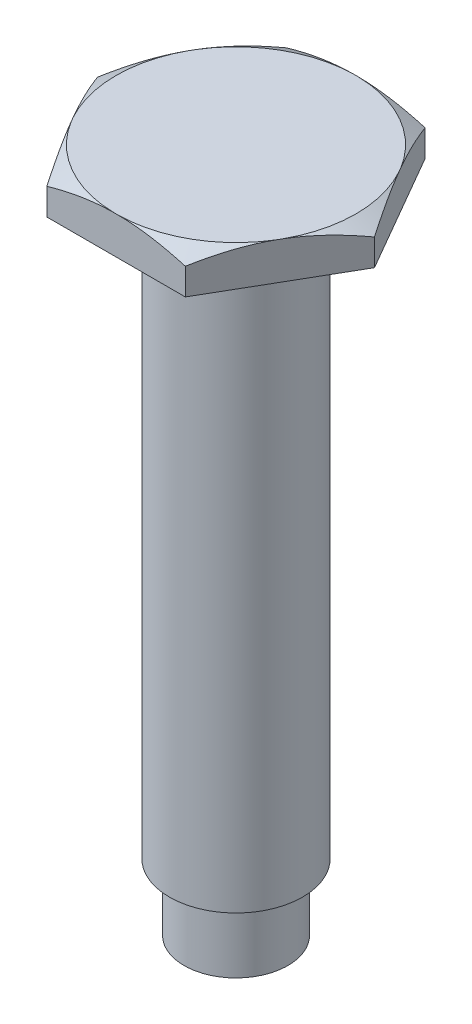
ISO-10303-21;
HEADER;
FILE_DESCRIPTION(('STEP AP214'),'2;1');
FILE_NAME('part.step','',(''),(''),'','','');
FILE_SCHEMA(('AUTOMOTIVE_DESIGN { 1 0 10303 214 1 1 1 1 }'));
ENDSEC;
DATA;
#1=APPLICATION_CONTEXT('core data for automotive mechanical design processes');
#2=APPLICATION_PROTOCOL_DEFINITION('international standard','automotive_design',2000,#1);
#3=PRODUCT_CONTEXT('',#1,'mechanical');
#4=PRODUCT('Part','Part','',(#3));
#5=PRODUCT_RELATED_PRODUCT_CATEGORY('part','',(#4));
#6=PRODUCT_DEFINITION_FORMATION('','',#4);
#7=PRODUCT_DEFINITION_CONTEXT('part definition',#1,'design');
#8=PRODUCT_DEFINITION('design','',#6,#7);
#9=PRODUCT_DEFINITION_SHAPE('','',#8);
#10=(LENGTH_UNIT() NAMED_UNIT(*) SI_UNIT(.MILLI.,.METRE.));
#11=(NAMED_UNIT(*) PLANE_ANGLE_UNIT() SI_UNIT($,.RADIAN.));
#12=(NAMED_UNIT(*) SI_UNIT($,.STERADIAN.) SOLID_ANGLE_UNIT());
#13=UNCERTAINTY_MEASURE_WITH_UNIT(LENGTH_MEASURE(1.E-05),#10,'distance_accuracy_value','');
#14=(GEOMETRIC_REPRESENTATION_CONTEXT(3) GLOBAL_UNCERTAINTY_ASSIGNED_CONTEXT((#13)) GLOBAL_UNIT_ASSIGNED_CONTEXT((#10,
#11,#12)) REPRESENTATION_CONTEXT('',''));
#15=CARTESIAN_POINT('',(0.,0.,0.));
#16=DIRECTION('',(0.,0.,1.));
#17=DIRECTION('',(1.,0.,0.));
#18=AXIS2_PLACEMENT_3D('',#15,#16,#17);
#19=CARTESIAN_POINT('',(0.,-24.3,0.));
#20=DIRECTION('',(0.,1.,0.));
#21=DIRECTION('',(0.,0.,1.));
#22=AXIS2_PLACEMENT_3D('',#19,#20,#21);
#23=CYLINDRICAL_SURFACE('',#22,2.5);
#24=CARTESIAN_POINT('',(0.,0.,0.));
#25=DIRECTION('',(0.,1.,0.));
#26=DIRECTION('',(0.,0.,1.));
#27=AXIS2_PLACEMENT_3D('',#24,#25,#26);
#28=CIRCLE('',#27,2.5);
#29=CARTESIAN_POINT('',(0.,0.,2.5));
#30=VERTEX_POINT('',#29);
#31=EDGE_CURVE('E13',#30,#30,#28,.F.);
#32=ORIENTED_EDGE('',*,*,#31,.T.);
#33=EDGE_LOOP('',(#32));
#34=FACE_BOUND('',#33,.T.);
#35=CARTESIAN_POINT('',(0.,-21.8,0.));
#36=DIRECTION('',(0.,-1.,0.));
#37=DIRECTION('',(0.,0.,-1.));
#38=AXIS2_PLACEMENT_3D('',#35,#36,#37);
#39=CIRCLE('',#38,2.5);
#40=CARTESIAN_POINT('',(0.,-21.8,-2.5));
#41=VERTEX_POINT('',#40);
#42=EDGE_CURVE('E61',#41,#41,#39,.T.);
#43=ORIENTED_EDGE('',*,*,#42,.F.);
#44=EDGE_LOOP('',(#43));
#45=FACE_BOUND('',#44,.T.);
#46=ADVANCED_FACE('F56',(#34,#45),#23,.T.);
#47=CARTESIAN_POINT('',(2.5975,1.4,4.49900197266016));
#48=DIRECTION('',(-0.866025403784439,0.,-0.5));
#49=DIRECTION('',(-0.5,0.,0.866025403784439));
#50=AXIS2_PLACEMENT_3D('',#47,#48,#49);
#51=PLANE('',#50);
#52=CARTESIAN_POINT('',(0.764746267767835,-0.454124789273067,7.67342455464776));
#53=CARTESIAN_POINT('',(0.846540705660757,-0.377433019190196,7.53175243244068));
#54=CARTESIAN_POINT('',(0.928528072742444,-0.301551957905063,7.3897461470764));
#55=CARTESIAN_POINT('',(1.09297003020882,-0.151791197053435,7.10492432184856));
#56=CARTESIAN_POINT('',(1.17542467594591,-0.0779117408474091,6.96210868611182));
#57=CARTESIAN_POINT('',(1.34112030157134,0.0676733695980131,6.67511544393666));
#58=CARTESIAN_POINT('',(1.42436293029547,0.139371540587462,6.53093498163088));
#59=CARTESIAN_POINT('',(1.59146398387532,0.279831230371151,6.24150746683229));
#60=CARTESIAN_POINT('',(1.67532238968743,0.348592839537418,6.09626044732398));
#61=CARTESIAN_POINT('',(1.84599265044855,0.484316646401144,5.80065088434469));
#62=CARTESIAN_POINT('',(1.93282376130974,0.551182431909523,5.65025498865547));
#63=CARTESIAN_POINT('',(2.10734549477341,0.680257160061498,5.3479744792714));
#64=CARTESIAN_POINT('',(2.19503606852409,0.742466365668551,5.19608995019036));
#65=CARTESIAN_POINT('',(2.37131571795982,0.861080845971694,4.89076464102724));
#66=CARTESIAN_POINT('',(2.45990392715668,0.917491222644587,4.73732536174674));
#67=CARTESIAN_POINT('',(2.63812027232068,1.02322633098802,4.42864559718346));
#68=CARTESIAN_POINT('',(2.72774827495578,1.07255196051071,4.27340534283854));
#69=CARTESIAN_POINT('',(2.94167693195855,1.17932065353719,3.90287003971477));
#70=CARTESIAN_POINT('',(3.06647240761128,1.23295723560288,3.68671793532951));
#71=CARTESIAN_POINT('',(3.25497393542946,1.29798014863304,3.36022371184407));
#72=CARTESIAN_POINT('',(3.31802487416995,1.31708228871089,3.25101628248064));
#73=CARTESIAN_POINT('',(3.44448603325496,1.34966788109555,3.03197912976134));
#74=CARTESIAN_POINT('',(3.50789620500962,1.36315207572337,2.92214949056561));
#75=CARTESIAN_POINT('',(3.63421230786921,1.3839969781063,2.7033635825987));
#76=CARTESIAN_POINT('',(3.69711530695999,1.39142837342597,2.59441239222501));
#77=CARTESIAN_POINT('',(3.82302741588169,1.40021353929659,2.37632622228448));
#78=CARTESIAN_POINT('',(3.88603652392881,1.40156741101706,2.26719124580728));
#79=CARTESIAN_POINT('',(4.01201417247894,1.39815550680156,2.04899155790038));
#80=CARTESIAN_POINT('',(4.07498271233779,1.39338963597678,1.93992684758643));
#81=CARTESIAN_POINT('',(4.20073678228329,1.37788386249752,1.72211440918226));
#82=CARTESIAN_POINT('',(4.26352230002154,1.36714356571949,1.6133667024801));
#83=CARTESIAN_POINT('',(4.41065120501361,1.33525044365775,1.35853196377184));
#84=CARTESIAN_POINT('',(4.49486953949365,1.31177164019821,1.2126615295236));
#85=CARTESIAN_POINT('',(4.66253101838631,1.25557216182377,0.922263329609364));
#86=CARTESIAN_POINT('',(4.74597403931673,1.22285003995282,0.777735777820844));
#87=CARTESIAN_POINT('',(4.91205251429679,1.14940005301191,0.490079421111826));
#88=CARTESIAN_POINT('',(4.99468708095955,1.10866424445279,0.346952153190496));
#89=CARTESIAN_POINT('',(5.15904334370627,1.02046987040766,0.0622787555710296));
#90=CARTESIAN_POINT('',(5.24076506447544,0.973011487190809,-0.0792674168831269));
#91=CARTESIAN_POINT('',(5.40431916872383,0.871907470927307,-0.362551435227752));
#92=CARTESIAN_POINT('',(5.48614102218207,0.818194179899497,-0.504271042586887));
#93=CARTESIAN_POINT('',(5.64897798391222,0.706057896456655,-0.786312933653649));
#94=CARTESIAN_POINT('',(5.72999301279723,0.647634445633892,-0.926635079859158));
#95=CARTESIAN_POINT('',(5.89125020454739,0.526954778850263,-1.2059407290563));
#96=CARTESIAN_POINT('',(5.97149278220745,0.464700769888742,-1.34492495049381));
#97=CARTESIAN_POINT('',(6.13134236600289,0.337008626902665,-1.62179255119626));
#98=CARTESIAN_POINT('',(6.21094935554493,0.271570410062166,-1.75967590172068));
#99=CARTESIAN_POINT('',(6.35269983057958,0.152286187773574,-2.00519492647773));
#100=CARTESIAN_POINT('',(6.41494928140599,0.0989419583375809,-2.11301413805233));
#101=CARTESIAN_POINT('',(6.53913777871832,-0.00915825365950849,-2.32811492511291));
#102=CARTESIAN_POINT('',(6.60107683757794,-0.063914179400276,-2.43539652203077));
#103=CARTESIAN_POINT('',(6.72394062975798,-0.173990162223894,-2.64820285249718));
#104=CARTESIAN_POINT('',(6.78486863438338,-0.229295639253393,-2.75373325211216));
#105=CARTESIAN_POINT('',(6.90648459300393,-0.340958275081431,-2.96437827145415));
#106=CARTESIAN_POINT('',(6.96717254297768,-0.397315451408354,-3.06949288421589));
#107=CARTESIAN_POINT('',(7.02775373223217,-0.454124789273058,-3.1744225819876));
#108=B_SPLINE_CURVE_WITH_KNOTS('',3,(#52,#53,#54,#55,#56,#57,#58,#59,#60,#61,#62,#63,#64,#65,
#66,#67,#68,#69,#70,#71,#72,#73,#74,#75,#76,#77,#78,#79,#80,#81,#82,#83,#84,#85,#86,#87,#88,#89,
#90,#91,#92,#93,#94,#95,#96,#97,#98,#99,#100,#101,#102,#103,#104,#105,#106,#107),.UNSPECIFIED.,
.F.,.F.,(4,2,2,2,2,2,2,2,2,2,2,2,2,2,2,2,2,2,2,2,2,2,2,2,2,2,2,4),(0.,0.542026372178204,
1.08411835228508,1.62789791735099,2.17166073564649,2.72987716868045,3.28806205464704,
3.84575155274402,4.40337031220445,5.16842888782534,5.550946692113,5.9334139367919,
6.31134777627519,6.68927532445917,7.06720873261637,7.44516707540755,7.95505681600911,
8.46502641941073,8.97550409574346,9.48596793414437,10.0025821226153,10.5192466504577,
11.0356162367859,11.5519992602125,11.9583277083475,12.3646398273455,12.7660923087187,
13.1675514869771),.UNSPECIFIED.);
#109=CARTESIAN_POINT('',(2.5975,0.998741562913211,4.49900197266016));
#110=VERTEX_POINT('',#109);
#111=CARTESIAN_POINT('',(3.84886527144745,1.4,2.33157374368596));
#112=VERTEX_POINT('',#111);
#113=EDGE_CURVE('E151',#110,#112,#108,.T.);
#114=ORIENTED_EDGE('',*,*,#113,.F.);
#115=DIRECTION('',(0.,-1.,0.));
#116=VECTOR('',#115,1.);
#117=CARTESIAN_POINT('',(2.5975,1.4,4.49900197266016));
#118=LINE('',#117,#116);
#119=CARTESIAN_POINT('',(2.5975,0.,4.49900197266016));
#120=VERTEX_POINT('',#119);
#121=EDGE_CURVE('E163',#110,#120,#118,.T.);
#122=ORIENTED_EDGE('',*,*,#121,.T.);
#123=DIRECTION('',(0.5,0.,-0.866025403784439));
#124=VECTOR('',#123,1.);
#125=CARTESIAN_POINT('',(2.5975,0.,4.49900197266016));
#126=LINE('',#125,#124);
#127=CARTESIAN_POINT('',(5.195,0.,0.));
#128=VERTEX_POINT('',#127);
#129=EDGE_CURVE('E176',#120,#128,#126,.T.);
#130=ORIENTED_EDGE('',*,*,#129,.T.);
#131=DIRECTION('',(0.,-1.,0.));
#132=VECTOR('',#131,1.);
#133=CARTESIAN_POINT('',(5.195,1.4,0.));
#134=LINE('',#133,#132);
#135=CARTESIAN_POINT('',(5.19500000000003,0.998741562913259,0.));
#136=VERTEX_POINT('',#135);
#137=EDGE_CURVE('E202',#136,#128,#134,.T.);
#138=ORIENTED_EDGE('',*,*,#137,.F.);
#139=CARTESIAN_POINT('',(3.94363472855255,1.4,2.1674282289742));
#140=VERTEX_POINT('',#139);
#141=EDGE_CURVE('E180',#140,#136,#108,.T.);
#142=ORIENTED_EDGE('',*,*,#141,.F.);
#143=DIRECTION('',(0.5,0.,-0.866025403784439));
#144=VECTOR('',#143,1.);
#145=CARTESIAN_POINT('',(2.5975,1.4,4.49900197266016));
#146=LINE('',#145,#144);
#147=EDGE_CURVE('E193',#112,#140,#146,.T.);
#148=ORIENTED_EDGE('',*,*,#147,.F.);
#149=EDGE_LOOP('',(#114,#122,#130,#138,#142,#148));
#150=FACE_BOUND('',#149,.T.);
#151=ADVANCED_FACE('F58',(#150),#51,.F.);
#152=CARTESIAN_POINT('',(5.195,1.4,0.));
#153=DIRECTION('',(-0.866025403784439,0.,0.5));
#154=DIRECTION('',(0.5,0.,0.866025403784439));
#155=AXIS2_PLACEMENT_3D('',#152,#153,#154);
#156=PLANE('',#155);
#157=CARTESIAN_POINT('',(7.02775373223216,-0.454124789273065,3.17442258198759));
#158=CARTESIAN_POINT('',(6.94595929433924,-0.377433019190193,3.03275045978052));
#159=CARTESIAN_POINT('',(6.86397192725755,-0.30155195790506,2.89074417441623));
#160=CARTESIAN_POINT('',(6.69952996979118,-0.151791197053433,2.6059223491884));
#161=CARTESIAN_POINT('',(6.61707532405409,-0.077911740847407,2.46310671345166));
#162=CARTESIAN_POINT('',(6.45137969842866,0.0676733695980147,2.1761134712765));
#163=CARTESIAN_POINT('',(6.36813706970453,0.139371540587463,2.03193300897072));
#164=CARTESIAN_POINT('',(6.20103601612468,0.279831230371152,1.74250549417213));
#165=CARTESIAN_POINT('',(6.11717761031257,0.34859283953742,1.59725847466382));
#166=CARTESIAN_POINT('',(5.94650734955145,0.484316646401146,1.30164891168453));
#167=CARTESIAN_POINT('',(5.85967623869026,0.551182431909525,1.15125301599531));
#168=CARTESIAN_POINT('',(5.68515450522659,0.680257160061499,0.848972506611236));
#169=CARTESIAN_POINT('',(5.59746393147591,0.742466365668553,0.697087977530198));
#170=CARTESIAN_POINT('',(5.42118428204018,0.861080845971696,0.391762668367075));
#171=CARTESIAN_POINT('',(5.33259607284332,0.917491222644589,0.238323389086572));
#172=CARTESIAN_POINT('',(5.15437972767932,1.02322633098802,-0.0703563754767021));
#173=CARTESIAN_POINT('',(5.06475172504421,1.07255196051071,-0.225596629821623));
#174=CARTESIAN_POINT('',(4.85082306804145,1.17932065353719,-0.596131932945389));
#175=CARTESIAN_POINT('',(4.72602759238872,1.23295723560288,-0.812284037330647));
#176=CARTESIAN_POINT('',(4.53752606457053,1.29798014863304,-1.1387782608161));
#177=CARTESIAN_POINT('',(4.47447512583005,1.31708228871089,-1.24798569017953));
#178=CARTESIAN_POINT('',(4.34801396674504,1.34966788109555,-1.46702284289882));
#179=CARTESIAN_POINT('',(4.28460379499038,1.36315207572337,-1.57685248209455));
#180=CARTESIAN_POINT('',(4.15828769213079,1.3839969781063,-1.79563839006147));
#181=CARTESIAN_POINT('',(4.09538469304001,1.39142837342597,-1.90458958043515));
#182=CARTESIAN_POINT('',(3.96947258411831,1.40021353929659,-2.12267575037568));
#183=CARTESIAN_POINT('',(3.90646347607119,1.40156741101706,-2.23181072685288));
#184=CARTESIAN_POINT('',(3.78048582752106,1.39815550680156,-2.45001041475978));
#185=CARTESIAN_POINT('',(3.71751728766221,1.39338963597678,-2.55907512507373));
#186=CARTESIAN_POINT('',(3.59176321771671,1.37788386249752,-2.7768875634779));
#187=CARTESIAN_POINT('',(3.52897769997846,1.36714356571949,-2.88563527018006));
#188=CARTESIAN_POINT('',(3.38184879498638,1.33525044365775,-3.14047000888832));
#189=CARTESIAN_POINT('',(3.29763046050635,1.31177164019821,-3.28634044313656));
#190=CARTESIAN_POINT('',(3.12996898161369,1.25557216182377,-3.57673864305079));
#191=CARTESIAN_POINT('',(3.04652596068327,1.22285003995282,-3.72126619483932));
#192=CARTESIAN_POINT('',(2.88044748570321,1.14940005301191,-4.00892255154833));
#193=CARTESIAN_POINT('',(2.79781291904045,1.10866424445279,-4.15204981946966));
#194=CARTESIAN_POINT('',(2.63345665629373,1.02046987040766,-4.43672321708913));
#195=CARTESIAN_POINT('',(2.55173493552456,0.973011487190809,-4.57826938954329));
#196=CARTESIAN_POINT('',(2.38818083127617,0.871907470927306,-4.86155340788791));
#197=CARTESIAN_POINT('',(2.30635897781793,0.818194179899496,-5.00327301524705));
#198=CARTESIAN_POINT('',(2.14352201608778,0.706057896456654,-5.28531490631381));
#199=CARTESIAN_POINT('',(2.06250698720276,0.647634445633891,-5.42563705251932));
#200=CARTESIAN_POINT('',(1.90124979545261,0.526954778850262,-5.70494270171646));
#201=CARTESIAN_POINT('',(1.82100721779255,0.46470076988874,-5.84392692315397));
#202=CARTESIAN_POINT('',(1.66115763399711,0.337008626902662,-6.12079452385642));
#203=CARTESIAN_POINT('',(1.58155064445506,0.271570410062163,-6.25867787438085));
#204=CARTESIAN_POINT('',(1.43980016942041,0.152286187773572,-6.50419689913789));
#205=CARTESIAN_POINT('',(1.377550718594,0.098941958337579,-6.61201611071249));
#206=CARTESIAN_POINT('',(1.25336222128168,-0.00915825365951011,-6.82711689777307));
#207=CARTESIAN_POINT('',(1.19142316242206,-0.0639141794002777,-6.93439849469092));
#208=CARTESIAN_POINT('',(1.06855937024202,-0.173990162223895,-7.14720482515734));
#209=CARTESIAN_POINT('',(1.00763136561662,-0.229295639253394,-7.25273522477232));
#210=CARTESIAN_POINT('',(0.886015406996071,-0.340958275081432,-7.46338024411431));
#211=CARTESIAN_POINT('',(0.825327457022315,-0.397315451408355,-7.56849485687605));
#212=CARTESIAN_POINT('',(0.764746267767833,-0.454124789273058,-7.67342455464776));
#213=B_SPLINE_CURVE_WITH_KNOTS('',3,(#157,#158,#159,#160,#161,#162,#163,#164,#165,#166,#167,
#168,#169,#170,#171,#172,#173,#174,#175,#176,#177,#178,#179,#180,#181,#182,#183,#184,#185,#186,
#187,#188,#189,#190,#191,#192,#193,#194,#195,#196,#197,#198,#199,#200,#201,#202,#203,#204,#205,
#206,#207,#208,#209,#210,#211,#212),.UNSPECIFIED.,.F.,.F.,(4,2,2,2,2,2,2,2,2,2,2,2,2,2,2,2,2,2,
2,2,2,2,2,2,2,2,2,4),(0.,0.542026372178205,1.08411835228508,1.62789791735099,2.17166073564649,
2.72987716868045,3.28806205464704,3.84575155274402,4.40337031220445,5.16842888782534,
5.550946692113,5.9334139367919,6.31134777627518,6.68927532445916,7.06720873261636,
7.44516707540755,7.9550568160091,8.46502641941072,8.97550409574346,9.48596793414437,
10.0025821226153,10.5192466504577,11.0356162367859,11.5519992602125,11.9583277083475,
12.3646398273455,12.7660923087187,13.1675514869771),.UNSPECIFIED.);
#214=CARTESIAN_POINT('',(3.94363472855255,1.4,-2.1674282289742));
#215=VERTEX_POINT('',#214);
#216=EDGE_CURVE('E238',#136,#215,#213,.T.);
#217=ORIENTED_EDGE('',*,*,#216,.F.);
#218=ORIENTED_EDGE('',*,*,#137,.T.);
#219=DIRECTION('',(-0.5,0.,-0.866025403784439));
#220=VECTOR('',#219,1.);
#221=CARTESIAN_POINT('',(5.195,0.,0.));
#222=LINE('',#221,#220);
#223=CARTESIAN_POINT('',(2.5975,0.,-4.49900197266016));
#224=VERTEX_POINT('',#223);
#225=EDGE_CURVE('E179',#128,#224,#222,.T.);
#226=ORIENTED_EDGE('',*,*,#225,.T.);
#227=DIRECTION('',(0.,-1.,0.));
#228=VECTOR('',#227,1.);
#229=CARTESIAN_POINT('',(2.5975,1.4,-4.49900197266016));
#230=LINE('',#229,#228);
#231=CARTESIAN_POINT('',(2.5975,0.998741562913212,-4.49900197266016));
#232=VERTEX_POINT('',#231);
#233=EDGE_CURVE('E200',#232,#224,#230,.T.);
#234=ORIENTED_EDGE('',*,*,#233,.F.);
#235=CARTESIAN_POINT('',(3.84886527144745,1.4,-2.33157374368596));
#236=VERTEX_POINT('',#235);
#237=EDGE_CURVE('E232',#236,#232,#213,.T.);
#238=ORIENTED_EDGE('',*,*,#237,.F.);
#239=DIRECTION('',(-0.5,0.,-0.866025403784439));
#240=VECTOR('',#239,1.);
#241=CARTESIAN_POINT('',(5.195,1.4,0.));
#242=LINE('',#241,#240);
#243=EDGE_CURVE('E227',#215,#236,#242,.T.);
#244=ORIENTED_EDGE('',*,*,#243,.F.);
#245=EDGE_LOOP('',(#217,#218,#226,#234,#238,#244));
#246=FACE_BOUND('',#245,.T.);
#247=ADVANCED_FACE('F246',(#246),#156,.F.);
#248=CARTESIAN_POINT('',(2.5975,1.4,-4.49900197266016));
#249=DIRECTION('',(0.,0.,1.));
#250=DIRECTION('',(1.,0.,0.));
#251=AXIS2_PLACEMENT_3D('',#248,#249,#250);
#252=PLANE('',#251);
#253=CARTESIAN_POINT('',(5.77192258198759,-0.227090808716546,-4.49900197266016));
#254=CARTESIAN_POINT('',(5.60913755966845,-0.152984369439807,-4.49900197266016));
#255=CARTESIAN_POINT('',(5.44591300460618,-0.0798254228658757,-4.49900197266016));
#256=CARTESIAN_POINT('',(5.11839636806293,0.0641385338696213,-4.49900197266016));
#257=CARTESIAN_POINT('',(4.9541041050891,0.134943130618416,-4.49900197266016));
#258=CARTESIAN_POINT('',(4.62365019074874,0.273995214668935,-4.49900197266016));
#259=CARTESIAN_POINT('',(4.45748365552962,0.342231139729387,-4.49900197266016));
#260=CARTESIAN_POINT('',(4.12376096204262,0.475206584033677,-4.49900197266016));
#261=CARTESIAN_POINT('',(3.95620486637187,0.539946259800704,-4.49900197266016));
#262=CARTESIAN_POINT('',(3.62014094058057,0.664910495326106,-4.49900197266016));
#263=CARTESIAN_POINT('',(3.45163923170269,0.725151431085589,-4.49900197266016));
#264=CARTESIAN_POINT('',(3.11284465445949,0.840435342818388,-4.49900197266016));
#265=CARTESIAN_POINT('',(2.94255166995606,0.895477979420265,-4.49900197266016));
#266=CARTESIAN_POINT('',(2.60024415659692,0.999126538813837,-4.49900197266016));
#267=CARTESIAN_POINT('',(2.42823222054523,1.04774093062003,-4.49900197266016));
#268=CARTESIAN_POINT('',(2.08222141630835,1.1372651045468,-4.49900197266016));
#269=CARTESIAN_POINT('',(1.90822263490411,1.17817522181794,-4.49900197266016));
#270=CARTESIAN_POINT('',(1.48338106639456,1.26633205480424,-4.49900197266016));
#271=CARTESIAN_POINT('',(1.23149635233239,1.30880729595718,-4.49900197266016));
#272=CARTESIAN_POINT('',(0.851636268195707,1.35541796650651,-4.49900197266016));
#273=CARTESIAN_POINT('',(0.724677188925095,1.3681044984636,-4.49900197266016));
#274=CARTESIAN_POINT('',(0.470303771867612,1.38743553984244,-4.49900197266016));
#275=CARTESIAN_POINT('',(0.342889490864874,1.39408077816295,-4.49900197266016));
#276=CARTESIAN_POINT('',(0.0879655096792876,1.40111945511139,-4.49900197266016));
#277=CARTESIAN_POINT('',(-0.0395440862933155,1.40151666976282,-4.49900197266016));
#278=CARTESIAN_POINT('',(-0.294427215994776,1.39605864535107,-4.49900197266016));
#279=CARTESIAN_POINT('',(-0.421800750546122,1.39020344430019,-4.49900197266016));
#280=CARTESIAN_POINT('',(-0.67612009637022,1.37241909335192,-4.49900197266016));
#281=CARTESIAN_POINT('',(-0.803065911348346,1.36048999621015,-4.49900197266016));
#282=CARTESIAN_POINT('',(-1.05629749340669,1.33090647036077,-4.49900197266016));
#283=CARTESIAN_POINT('',(-1.18258313686381,1.3132510057949,-4.49900197266016));
#284=CARTESIAN_POINT('',(-1.69482776062332,1.23064719090392,-4.49900197266016));
#285=CARTESIAN_POINT('',(-2.07730821187047,1.14344279907834,-4.49900197266016));
#286=CARTESIAN_POINT('',(-2.64380905996445,0.986818585267799,-4.49900197266016));
#287=CARTESIAN_POINT('',(-2.83170917259291,0.930205673031296,-4.49900197266016));
#288=CARTESIAN_POINT('',(-3.20529209927546,0.810030633732534,-4.49900197266016));
#289=CARTESIAN_POINT('',(-3.39097508137221,0.746469037087198,-4.49900197266016));
#290=CARTESIAN_POINT('',(-3.76270287607295,0.612937713374495,-4.49900197266016));
#291=CARTESIAN_POINT('',(-3.94872142031268,0.542895859459579,-4.49900197266016));
#292=CARTESIAN_POINT('',(-4.3189879420537,0.398256135634828,-4.49900197266016));
#293=CARTESIAN_POINT('',(-4.50323580111474,0.323657963376374,-4.49900197266016));
#294=CARTESIAN_POINT('',(-4.86897004788675,0.171331942110032,-4.49900197266016));
#295=CARTESIAN_POINT('',(-5.05046667596422,0.0936285461315302,-4.49900197266016));
#296=CARTESIAN_POINT('',(-5.41212709767287,-0.064699465637042,-4.49900197266016));
#297=CARTESIAN_POINT('',(-5.59229122543423,-0.145323316986271,-4.49900197266016));
#298=CARTESIAN_POINT('',(-5.7719225819876,-0.227090808716548,-4.49900197266016));
#299=B_SPLINE_CURVE_WITH_KNOTS('',3,(#253,#254,#255,#256,#257,#258,#259,#260,#261,#262,#263,
#264,#265,#266,#267,#268,#269,#270,#271,#272,#273,#274,#275,#276,#277,#278,#279,#280,#281,#282,
#283,#284,#285,#286,#287,#288,#289,#290,#291,#292,#293,#294,#295,#296,#297,#298),.UNSPECIFIED.,
.F.,.F.,(4,2,2,2,2,2,2,2,2,2,2,2,2,2,2,2,2,2,2,2,2,2,4),(0.,0.536586650514957,1.07326703082519,
1.61212860577172,2.15096603645265,2.68773532632305,3.2245396350365,3.76062952038355,
4.29669607941342,5.06200202870462,5.44465629336931,5.827264383611,6.20964123390159,
6.59201575950021,6.97438696399191,7.35682737526941,8.53074642990351,9.11943237505045,
9.70807341511456,10.3043127706032,10.9005917344777,11.4928560768004,12.0849664961993),.UNSPECIFIED.);
#300=CARTESIAN_POINT('',(0.0947694571050346,1.4,-4.49900197266016));
#301=VERTEX_POINT('',#300);
#302=EDGE_CURVE('E239',#232,#301,#299,.T.);
#303=ORIENTED_EDGE('',*,*,#302,.F.);
#304=ORIENTED_EDGE('',*,*,#233,.T.);
#305=DIRECTION('',(-1.,0.,0.));
#306=VECTOR('',#305,1.);
#307=CARTESIAN_POINT('',(2.5975,0.,-4.49900197266016));
#308=LINE('',#307,#306);
#309=CARTESIAN_POINT('',(-2.5975,0.,-4.49900197266016));
#310=VERTEX_POINT('',#309);
#311=EDGE_CURVE('E183',#224,#310,#308,.T.);
#312=ORIENTED_EDGE('',*,*,#311,.T.);
#313=DIRECTION('',(0.,-1.,0.));
#314=VECTOR('',#313,1.);
#315=CARTESIAN_POINT('',(-2.5975,1.4,-4.49900197266016));
#316=LINE('',#315,#314);
#317=CARTESIAN_POINT('',(-2.59749999999996,0.998741562913258,-4.49900197266022));
#318=VERTEX_POINT('',#317);
#319=EDGE_CURVE('E198',#318,#310,#316,.T.);
#320=ORIENTED_EDGE('',*,*,#319,.F.);
#321=CARTESIAN_POINT('',(-0.0947694571050331,1.4,-4.49900197266016));
#322=VERTEX_POINT('',#321);
#323=EDGE_CURVE('E240',#322,#318,#299,.T.);
#324=ORIENTED_EDGE('',*,*,#323,.F.);
#325=DIRECTION('',(-1.,0.,0.));
#326=VECTOR('',#325,1.);
#327=CARTESIAN_POINT('',(2.5975,1.4,-4.49900197266016));
#328=LINE('',#327,#326);
#329=EDGE_CURVE('E216',#301,#322,#328,.T.);
#330=ORIENTED_EDGE('',*,*,#329,.F.);
#331=EDGE_LOOP('',(#303,#304,#312,#320,#324,#330));
#332=FACE_BOUND('',#331,.T.);
#333=ADVANCED_FACE('F283',(#332),#252,.F.);
#334=CARTESIAN_POINT('',(-2.5975,1.4,-4.49900197266016));
#335=DIRECTION('',(0.866025403784439,0.,0.5));
#336=DIRECTION('',(0.5,0.,-0.866025403784439));
#337=AXIS2_PLACEMENT_3D('',#334,#335,#336);
#338=PLANE('',#337);
#339=CARTESIAN_POINT('',(-0.764746267767833,-0.454124789273067,-7.67342455464776));
#340=CARTESIAN_POINT('',(-0.846540705660756,-0.377433019190196,-7.53175243244068));
#341=CARTESIAN_POINT('',(-0.928528072742443,-0.301551957905063,-7.3897461470764));
#342=CARTESIAN_POINT('',(-1.09297003020882,-0.151791197053435,-7.10492432184856));
#343=CARTESIAN_POINT('',(-1.17542467594591,-0.0779117408474092,-6.96210868611182));
#344=CARTESIAN_POINT('',(-1.34112030157134,0.0676733695980126,-6.67511544393666));
#345=CARTESIAN_POINT('',(-1.42436293029547,0.139371540587461,-6.53093498163088));
#346=CARTESIAN_POINT('',(-1.59146398387532,0.27983123037115,-6.24150746683229));
#347=CARTESIAN_POINT('',(-1.67532238968743,0.348592839537418,-6.09626044732398));
#348=CARTESIAN_POINT('',(-1.84599265044855,0.484316646401144,-5.80065088434469));
#349=CARTESIAN_POINT('',(-1.93282376130974,0.551182431909523,-5.65025498865547));
#350=CARTESIAN_POINT('',(-2.10734549477341,0.680257160061497,-5.3479744792714));
#351=CARTESIAN_POINT('',(-2.19503606852409,0.742466365668551,-5.19608995019036));
#352=CARTESIAN_POINT('',(-2.37131571795982,0.861080845971694,-4.89076464102724));
#353=CARTESIAN_POINT('',(-2.45990392715668,0.917491222644587,-4.73732536174674));
#354=CARTESIAN_POINT('',(-2.63812027232068,1.02322633098802,-4.42864559718346));
#355=CARTESIAN_POINT('',(-2.72774827495578,1.07255196051071,-4.27340534283854));
#356=CARTESIAN_POINT('',(-2.94167693195855,1.17932065353718,-3.90287003971478));
#357=CARTESIAN_POINT('',(-3.06647240761128,1.23295723560288,-3.68671793532952));
#358=CARTESIAN_POINT('',(-3.25497393542946,1.29798014863304,-3.36022371184407));
#359=CARTESIAN_POINT('',(-3.31802487416995,1.31708228871089,-3.25101628248064));
#360=CARTESIAN_POINT('',(-3.44448603325496,1.34966788109555,-3.03197912976134));
#361=CARTESIAN_POINT('',(-3.50789620500962,1.36315207572337,-2.92214949056561));
#362=CARTESIAN_POINT('',(-3.63421230786921,1.3839969781063,-2.7033635825987));
#363=CARTESIAN_POINT('',(-3.69711530695999,1.39142837342596,-2.59441239222502));
#364=CARTESIAN_POINT('',(-3.82302741588169,1.40021353929659,-2.37632622228448));
#365=CARTESIAN_POINT('',(-3.8860365239288,1.40156741101706,-2.26719124580728));
#366=CARTESIAN_POINT('',(-4.01201417247894,1.39815550680156,-2.04899155790039));
#367=CARTESIAN_POINT('',(-4.07498271233779,1.39338963597678,-1.93992684758643));
#368=CARTESIAN_POINT('',(-4.20073678228329,1.37788386249752,-1.72211440918227));
#369=CARTESIAN_POINT('',(-4.26352230002154,1.36714356571949,-1.6133667024801));
#370=CARTESIAN_POINT('',(-4.41065120501361,1.33525044365775,-1.35853196377185));
#371=CARTESIAN_POINT('',(-4.49486953949365,1.31177164019821,-1.2126615295236));
#372=CARTESIAN_POINT('',(-4.66253101838631,1.25557216182377,-0.922263329609371));
#373=CARTESIAN_POINT('',(-4.74597403931673,1.22285003995282,-0.77773577782085));
#374=CARTESIAN_POINT('',(-4.91205251429679,1.14940005301191,-0.490079421111832));
#375=CARTESIAN_POINT('',(-4.99468708095954,1.10866424445279,-0.346952153190502));
#376=CARTESIAN_POINT('',(-5.15904334370627,1.02046987040766,-0.062278755571036));
#377=CARTESIAN_POINT('',(-5.24076506447544,0.97301148719081,0.0792674168831205));
#378=CARTESIAN_POINT('',(-5.40431916872383,0.871907470927308,0.362551435227746));
#379=CARTESIAN_POINT('',(-5.48614102218207,0.818194179899498,0.50427104258688));
#380=CARTESIAN_POINT('',(-5.64897798391222,0.706057896456656,0.786312933653643));
#381=CARTESIAN_POINT('',(-5.72999301279723,0.647634445633894,0.926635079859152));
#382=CARTESIAN_POINT('',(-5.89125020454739,0.526954778850265,1.20594072905629));
#383=CARTESIAN_POINT('',(-5.97149278220745,0.464700769888743,1.34492495049381));
#384=CARTESIAN_POINT('',(-6.13134236600289,0.337008626902666,1.62179255119625));
#385=CARTESIAN_POINT('',(-6.21094935554493,0.271570410062167,1.75967590172068));
#386=CARTESIAN_POINT('',(-6.35269983057958,0.152286187773576,2.00519492647772));
#387=CARTESIAN_POINT('',(-6.41494928140599,0.0989419583375829,2.11301413805232));
#388=CARTESIAN_POINT('',(-6.53913777871832,-0.00915825365950742,2.3281149251129));
#389=CARTESIAN_POINT('',(-6.60107683757794,-0.0639141794002759,2.43539652203076));
#390=CARTESIAN_POINT('',(-6.72394062975798,-0.173990162223894,2.64820285249718));
#391=CARTESIAN_POINT('',(-6.78486863438338,-0.229295639253393,2.75373325211216));
#392=CARTESIAN_POINT('',(-6.90648459300393,-0.340958275081431,2.96437827145414));
#393=CARTESIAN_POINT('',(-6.96717254297768,-0.397315451408355,3.06949288421589));
#394=CARTESIAN_POINT('',(-7.02775373223217,-0.454124789273059,3.1744225819876));
#395=B_SPLINE_CURVE_WITH_KNOTS('',3,(#339,#340,#341,#342,#343,#344,#345,#346,#347,#348,#349,
#350,#351,#352,#353,#354,#355,#356,#357,#358,#359,#360,#361,#362,#363,#364,#365,#366,#367,#368,
#369,#370,#371,#372,#373,#374,#375,#376,#377,#378,#379,#380,#381,#382,#383,#384,#385,#386,#387,
#388,#389,#390,#391,#392,#393,#394),.UNSPECIFIED.,.F.,.F.,(4,2,2,2,2,2,2,2,2,2,2,2,2,2,2,2,2,2,
2,2,2,2,2,2,2,2,2,4),(0.,0.542026372178204,1.08411835228508,1.62789791735099,2.17166073564649,
2.72987716868045,3.28806205464704,3.84575155274402,4.40337031220445,5.16842888782534,
5.550946692113,5.9334139367919,6.31134777627518,6.68927532445916,7.06720873261636,
7.44516707540755,7.9550568160091,8.46502641941072,8.97550409574346,9.48596793414436,
10.0025821226153,10.5192466504577,11.0356162367859,11.5519992602125,11.9583277083475,
12.3646398273455,12.7660923087187,13.1675514869771),.UNSPECIFIED.);
#396=CARTESIAN_POINT('',(-3.84886527144748,1.4,-2.3315737436859));
#397=VERTEX_POINT('',#396);
#398=EDGE_CURVE('E223',#318,#397,#395,.T.);
#399=ORIENTED_EDGE('',*,*,#398,.F.);
#400=ORIENTED_EDGE('',*,*,#319,.T.);
#401=DIRECTION('',(-0.5,0.,0.866025403784439));
#402=VECTOR('',#401,1.);
#403=CARTESIAN_POINT('',(-2.5975,0.,-4.49900197266016));
#404=LINE('',#403,#402);
#405=CARTESIAN_POINT('',(-5.195,0.,0.));
#406=VERTEX_POINT('',#405);
#407=EDGE_CURVE('E186',#310,#406,#404,.T.);
#408=ORIENTED_EDGE('',*,*,#407,.T.);
#409=DIRECTION('',(0.,-1.,0.));
#410=VECTOR('',#409,1.);
#411=CARTESIAN_POINT('',(-5.195,1.4,0.));
#412=LINE('',#411,#410);
#413=CARTESIAN_POINT('',(-5.19500000000004,0.998741562913258,0.));
#414=VERTEX_POINT('',#413);
#415=EDGE_CURVE('E196',#414,#406,#412,.T.);
#416=ORIENTED_EDGE('',*,*,#415,.F.);
#417=CARTESIAN_POINT('',(-3.94363472855252,1.4,-2.16742822897426));
#418=VERTEX_POINT('',#417);
#419=EDGE_CURVE('E226',#418,#414,#395,.T.);
#420=ORIENTED_EDGE('',*,*,#419,.F.);
#421=DIRECTION('',(-0.5,0.,0.866025403784439));
#422=VECTOR('',#421,1.);
#423=CARTESIAN_POINT('',(-2.5975,1.4,-4.49900197266016));
#424=LINE('',#423,#422);
#425=EDGE_CURVE('E172',#397,#418,#424,.T.);
#426=ORIENTED_EDGE('',*,*,#425,.F.);
#427=EDGE_LOOP('',(#399,#400,#408,#416,#420,#426));
#428=FACE_BOUND('',#427,.T.);
#429=ADVANCED_FACE('F222',(#428),#338,.F.);
#430=CARTESIAN_POINT('',(-5.195,1.4,0.));
#431=DIRECTION('',(0.866025403784439,0.,-0.5));
#432=DIRECTION('',(-0.5,0.,-0.866025403784439));
#433=AXIS2_PLACEMENT_3D('',#430,#431,#432);
#434=PLANE('',#433);
#435=CARTESIAN_POINT('',(-7.02775373223217,-0.454124789273066,-3.1744225819876));
#436=CARTESIAN_POINT('',(-6.94595929433924,-0.377433019190195,-3.03275045978052));
#437=CARTESIAN_POINT('',(-6.86397192725756,-0.301551957905062,-2.89074417441624));
#438=CARTESIAN_POINT('',(-6.69952996979118,-0.151791197053434,-2.6059223491884));
#439=CARTESIAN_POINT('',(-6.61707532405409,-0.077911740847408,-2.46310671345166));
#440=CARTESIAN_POINT('',(-6.45137969842866,0.0676733695980137,-2.1761134712765));
#441=CARTESIAN_POINT('',(-6.36813706970453,0.139371540587463,-2.03193300897072));
#442=CARTESIAN_POINT('',(-6.20103601612468,0.279831230371152,-1.74250549417213));
#443=CARTESIAN_POINT('',(-6.11717761031257,0.348592839537419,-1.59725847466382));
#444=CARTESIAN_POINT('',(-5.94650734955145,0.484316646401145,-1.30164891168453));
#445=CARTESIAN_POINT('',(-5.85967623869026,0.551182431909524,-1.15125301599531));
#446=CARTESIAN_POINT('',(-5.68515450522659,0.680257160061498,-0.848972506611238));
#447=CARTESIAN_POINT('',(-5.59746393147591,0.742466365668552,-0.6970879775302));
#448=CARTESIAN_POINT('',(-5.42118428204018,0.861080845971695,-0.391762668367077));
#449=CARTESIAN_POINT('',(-5.33259607284332,0.917491222644588,-0.238323389086575));
#450=CARTESIAN_POINT('',(-5.15437972767932,1.02322633098802,0.0703563754767001));
#451=CARTESIAN_POINT('',(-5.06475172504422,1.07255196051071,0.225596629821621));
#452=CARTESIAN_POINT('',(-4.85082306804145,1.17932065353719,0.596131932945387));
#453=CARTESIAN_POINT('',(-4.72602759238872,1.23295723560288,0.812284037330646));
#454=CARTESIAN_POINT('',(-4.53752606457053,1.29798014863304,1.13877826081609));
#455=CARTESIAN_POINT('',(-4.47447512583005,1.31708228871089,1.24798569017952));
#456=CARTESIAN_POINT('',(-4.34801396674504,1.34966788109555,1.46702284289882));
#457=CARTESIAN_POINT('',(-4.28460379499038,1.36315207572337,1.57685248209455));
#458=CARTESIAN_POINT('',(-4.15828769213079,1.3839969781063,1.79563839006146));
#459=CARTESIAN_POINT('',(-4.09538469304001,1.39142837342596,1.90458958043514));
#460=CARTESIAN_POINT('',(-3.96947258411831,1.40021353929659,2.12267575037568));
#461=CARTESIAN_POINT('',(-3.90646347607119,1.40156741101706,2.23181072685288));
#462=CARTESIAN_POINT('',(-3.78048582752106,1.39815550680156,2.45001041475978));
#463=CARTESIAN_POINT('',(-3.71751728766221,1.39338963597678,2.55907512507373));
#464=CARTESIAN_POINT('',(-3.59176321771671,1.37788386249752,2.7768875634779));
#465=CARTESIAN_POINT('',(-3.52897769997846,1.36714356571949,2.88563527018006));
#466=CARTESIAN_POINT('',(-3.38184879498639,1.33525044365775,3.14047000888832));
#467=CARTESIAN_POINT('',(-3.29763046050635,1.31177164019821,3.28634044313656));
#468=CARTESIAN_POINT('',(-3.12996898161369,1.25557216182377,3.5767386430508));
#469=CARTESIAN_POINT('',(-3.04652596068327,1.22285003995282,3.72126619483932));
#470=CARTESIAN_POINT('',(-2.88044748570321,1.14940005301191,4.00892255154833));
#471=CARTESIAN_POINT('',(-2.79781291904045,1.10866424445279,4.15204981946966));
#472=CARTESIAN_POINT('',(-2.63345665629373,1.02046987040766,4.43672321708913));
#473=CARTESIAN_POINT('',(-2.55173493552456,0.973011487190808,4.57826938954329));
#474=CARTESIAN_POINT('',(-2.38818083127617,0.871907470927305,4.86155340788791));
#475=CARTESIAN_POINT('',(-2.30635897781793,0.818194179899496,5.00327301524705));
#476=CARTESIAN_POINT('',(-2.14352201608778,0.706057896456654,5.28531490631381));
#477=CARTESIAN_POINT('',(-2.06250698720277,0.647634445633891,5.42563705251932));
#478=CARTESIAN_POINT('',(-1.90124979545261,0.526954778850262,5.70494270171646));
#479=CARTESIAN_POINT('',(-1.82100721779255,0.46470076988874,5.84392692315397));
#480=CARTESIAN_POINT('',(-1.66115763399711,0.337008626902662,6.12079452385642));
#481=CARTESIAN_POINT('',(-1.58155064445507,0.271570410062163,6.25867787438085));
#482=CARTESIAN_POINT('',(-1.43980016942041,0.152286187773572,6.50419689913789));
#483=CARTESIAN_POINT('',(-1.37755071859401,0.0989419583375785,6.61201611071249));
#484=CARTESIAN_POINT('',(-1.25336222128168,-0.00915825365951057,6.82711689777307));
#485=CARTESIAN_POINT('',(-1.19142316242206,-0.0639141794002782,6.93439849469093));
#486=CARTESIAN_POINT('',(-1.06855937024202,-0.173990162223895,7.14720482515734));
#487=CARTESIAN_POINT('',(-1.00763136561662,-0.229295639253394,7.25273522477232));
#488=CARTESIAN_POINT('',(-0.886015406996073,-0.340958275081431,7.46338024411431));
#489=CARTESIAN_POINT('',(-0.825327457022317,-0.397315451408355,7.56849485687605));
#490=CARTESIAN_POINT('',(-0.764746267767834,-0.454124789273058,7.67342455464776));
#491=B_SPLINE_CURVE_WITH_KNOTS('',3,(#435,#436,#437,#438,#439,#440,#441,#442,#443,#444,#445,
#446,#447,#448,#449,#450,#451,#452,#453,#454,#455,#456,#457,#458,#459,#460,#461,#462,#463,#464,
#465,#466,#467,#468,#469,#470,#471,#472,#473,#474,#475,#476,#477,#478,#479,#480,#481,#482,#483,
#484,#485,#486,#487,#488,#489,#490),.UNSPECIFIED.,.F.,.F.,(4,2,2,2,2,2,2,2,2,2,2,2,2,2,2,2,2,2,
2,2,2,2,2,2,2,2,2,4),(0.,0.542026372178205,1.08411835228508,1.62789791735099,2.17166073564649,
2.72987716868045,3.28806205464704,3.84575155274403,4.40337031220445,5.16842888782534,
5.550946692113,5.9334139367919,6.31134777627519,6.68927532445917,7.06720873261637,
7.44516707540755,7.95505681600911,8.46502641941073,8.97550409574347,9.48596793414437,
10.0025821226153,10.5192466504577,11.0356162367859,11.5519992602125,11.9583277083475,
12.3646398273455,12.7660923087187,13.1675514869771),.UNSPECIFIED.);
#492=CARTESIAN_POINT('',(-3.94363472855252,1.4,2.16742822897426));
#493=VERTEX_POINT('',#492);
#494=EDGE_CURVE('E81',#414,#493,#491,.T.);
#495=ORIENTED_EDGE('',*,*,#494,.F.);
#496=ORIENTED_EDGE('',*,*,#415,.T.);
#497=DIRECTION('',(0.5,0.,0.866025403784439));
#498=VECTOR('',#497,1.);
#499=CARTESIAN_POINT('',(-5.195,0.,0.));
#500=LINE('',#499,#498);
#501=CARTESIAN_POINT('',(-2.5975,0.,4.49900197266016));
#502=VERTEX_POINT('',#501);
#503=EDGE_CURVE('E189',#406,#502,#500,.T.);
#504=ORIENTED_EDGE('',*,*,#503,.T.);
#505=DIRECTION('',(0.,-1.,0.));
#506=VECTOR('',#505,1.);
#507=CARTESIAN_POINT('',(-2.5975,1.4,4.49900197266016));
#508=LINE('',#507,#506);
#509=CARTESIAN_POINT('',(-2.5975,0.998741562913212,4.49900197266016));
#510=VERTEX_POINT('',#509);
#511=EDGE_CURVE('E170',#510,#502,#508,.T.);
#512=ORIENTED_EDGE('',*,*,#511,.F.);
#513=CARTESIAN_POINT('',(-3.84886527144748,1.4,2.3315737436859));
#514=VERTEX_POINT('',#513);
#515=EDGE_CURVE('E271',#514,#510,#491,.T.);
#516=ORIENTED_EDGE('',*,*,#515,.F.);
#517=DIRECTION('',(0.5,0.,0.866025403784439));
#518=VECTOR('',#517,1.);
#519=CARTESIAN_POINT('',(-5.195,1.4,0.));
#520=LINE('',#519,#518);
#521=EDGE_CURVE('E168',#493,#514,#520,.T.);
#522=ORIENTED_EDGE('',*,*,#521,.F.);
#523=EDGE_LOOP('',(#495,#496,#504,#512,#516,#522));
#524=FACE_BOUND('',#523,.T.);
#525=ADVANCED_FACE('F282',(#524),#434,.F.);
#526=CARTESIAN_POINT('',(-2.5975,1.4,4.49900197266016));
#527=DIRECTION('',(0.,0.,-1.));
#528=DIRECTION('',(-1.,0.,0.));
#529=AXIS2_PLACEMENT_3D('',#526,#527,#528);
#530=PLANE('',#529);
#531=CARTESIAN_POINT('',(-5.7719225819876,-0.227090808716547,4.49900197266016));
#532=CARTESIAN_POINT('',(-5.60913755966845,-0.152984369439808,4.49900197266016));
#533=CARTESIAN_POINT('',(-5.44591300460618,-0.0798254228658768,4.49900197266016));
#534=CARTESIAN_POINT('',(-5.11839636806293,0.0641385338696201,4.49900197266016));
#535=CARTESIAN_POINT('',(-4.95410410508911,0.134943130618415,4.49900197266016));
#536=CARTESIAN_POINT('',(-4.62365019074875,0.273995214668933,4.49900197266016));
#537=CARTESIAN_POINT('',(-4.45748365552963,0.342231139729385,4.49900197266016));
#538=CARTESIAN_POINT('',(-4.12376096204263,0.475206584033675,4.49900197266016));
#539=CARTESIAN_POINT('',(-3.95620486637188,0.539946259800702,4.49900197266016));
#540=CARTESIAN_POINT('',(-3.62014094058057,0.664910495326105,4.49900197266016));
#541=CARTESIAN_POINT('',(-3.4516392317027,0.725151431085589,4.49900197266016));
#542=CARTESIAN_POINT('',(-3.11284465445949,0.840435342818387,4.49900197266016));
#543=CARTESIAN_POINT('',(-2.94255166995606,0.895477979420264,4.49900197266016));
#544=CARTESIAN_POINT('',(-2.60024415659692,0.999126538813836,4.49900197266016));
#545=CARTESIAN_POINT('',(-2.42823222054524,1.04774093062003,4.49900197266016));
#546=CARTESIAN_POINT('',(-2.08222141630835,1.1372651045468,4.49900197266016));
#547=CARTESIAN_POINT('',(-1.90822263490412,1.17817522181794,4.49900197266016));
#548=CARTESIAN_POINT('',(-1.48338106639457,1.26633205480424,4.49900197266016));
#549=CARTESIAN_POINT('',(-1.2314963523324,1.30880729595718,4.49900197266016));
#550=CARTESIAN_POINT('',(-0.851636268195712,1.35541796650651,4.49900197266016));
#551=CARTESIAN_POINT('',(-0.724677188925101,1.3681044984636,4.49900197266016));
#552=CARTESIAN_POINT('',(-0.470303771867617,1.38743553984244,4.49900197266016));
#553=CARTESIAN_POINT('',(-0.342889490864879,1.39408077816295,4.49900197266016));
#554=CARTESIAN_POINT('',(-0.0879655096792928,1.40111945511139,4.49900197266016));
#555=CARTESIAN_POINT('',(0.0395440862933101,1.40151666976282,4.49900197266016));
#556=CARTESIAN_POINT('',(0.29442721599477,1.39605864535107,4.49900197266016));
#557=CARTESIAN_POINT('',(0.421800750546116,1.39020344430019,4.49900197266016));
#558=CARTESIAN_POINT('',(0.676120096370215,1.37241909335192,4.49900197266016));
#559=CARTESIAN_POINT('',(0.803065911348341,1.36048999621015,4.49900197266016));
#560=CARTESIAN_POINT('',(1.05629749340669,1.33090647036077,4.49900197266016));
#561=CARTESIAN_POINT('',(1.18258313686381,1.3132510057949,4.49900197266016));
#562=CARTESIAN_POINT('',(1.69482776062331,1.23064719090393,4.49900197266016));
#563=CARTESIAN_POINT('',(2.07730821187046,1.14344279907834,4.49900197266016));
#564=CARTESIAN_POINT('',(2.64380905996445,0.9868185852678,4.49900197266016));
#565=CARTESIAN_POINT('',(2.8317091725929,0.930205673031297,4.49900197266016));
#566=CARTESIAN_POINT('',(3.20529209927546,0.810030633732535,4.49900197266016));
#567=CARTESIAN_POINT('',(3.39097508137221,0.746469037087199,4.49900197266016));
#568=CARTESIAN_POINT('',(3.76270287607295,0.612937713374496,4.49900197266016));
#569=CARTESIAN_POINT('',(3.94872142031268,0.54289585945958,4.49900197266016));
#570=CARTESIAN_POINT('',(4.3189879420537,0.398256135634829,4.49900197266016));
#571=CARTESIAN_POINT('',(4.50323580111474,0.323657963376375,4.49900197266016));
#572=CARTESIAN_POINT('',(4.86897004788674,0.171331942110033,4.49900197266016));
#573=CARTESIAN_POINT('',(5.05046667596422,0.0936285461315312,4.49900197266016));
#574=CARTESIAN_POINT('',(5.41212709767287,-0.0646994656370415,4.49900197266016));
#575=CARTESIAN_POINT('',(5.59229122543423,-0.145323316986271,4.49900197266016));
#576=CARTESIAN_POINT('',(5.7719225819876,-0.227090808716548,4.49900197266016));
#577=B_SPLINE_CURVE_WITH_KNOTS('',3,(#531,#532,#533,#534,#535,#536,#537,#538,#539,#540,#541,
#542,#543,#544,#545,#546,#547,#548,#549,#550,#551,#552,#553,#554,#555,#556,#557,#558,#559,#560,
#561,#562,#563,#564,#565,#566,#567,#568,#569,#570,#571,#572,#573,#574,#575,#576),.UNSPECIFIED.,
.F.,.F.,(4,2,2,2,2,2,2,2,2,2,2,2,2,2,2,2,2,2,2,2,2,2,4),(0.,0.536586650514957,1.07326703082519,
1.61212860577171,2.15096603645264,2.68773532632304,3.2245396350365,3.76062952038355,
4.29669607941342,5.06200202870461,5.44465629336931,5.827264383611,6.20964123390159,
6.59201575950021,6.97438696399191,7.35682737526941,8.53074642990351,9.11943237505045,
9.70807341511456,10.3043127706033,10.9005917344777,11.4928560768004,12.0849664961993),.UNSPECIFIED.);
#578=CARTESIAN_POINT('',(-0.0947694571050353,1.4,4.49900197266016));
#579=VERTEX_POINT('',#578);
#580=EDGE_CURVE('E73',#510,#579,#577,.T.);
#581=ORIENTED_EDGE('',*,*,#580,.F.);
#582=ORIENTED_EDGE('',*,*,#511,.T.);
#583=DIRECTION('',(1.,0.,0.));
#584=VECTOR('',#583,1.);
#585=CARTESIAN_POINT('',(-2.5975,0.,4.49900197266016));
#586=LINE('',#585,#584);
#587=EDGE_CURVE('E192',#502,#120,#586,.T.);
#588=ORIENTED_EDGE('',*,*,#587,.T.);
#589=ORIENTED_EDGE('',*,*,#121,.F.);
#590=CARTESIAN_POINT('',(0.0947694571050323,1.4,4.49900197266016));
#591=VERTEX_POINT('',#590);
#592=EDGE_CURVE('E149',#591,#110,#577,.T.);
#593=ORIENTED_EDGE('',*,*,#592,.F.);
#594=DIRECTION('',(1.,0.,0.));
#595=VECTOR('',#594,1.);
#596=CARTESIAN_POINT('',(-2.5975,1.4,4.49900197266016));
#597=LINE('',#596,#595);
#598=EDGE_CURVE('E161',#579,#591,#597,.T.);
#599=ORIENTED_EDGE('',*,*,#598,.F.);
#600=EDGE_LOOP('',(#581,#582,#588,#589,#593,#599));
#601=FACE_BOUND('',#600,.T.);
#602=ADVANCED_FACE('F160',(#601),#530,.F.);
#603=CARTESIAN_POINT('',(0.,1.4,0.));
#604=DIRECTION('',(0.,1.,0.));
#605=DIRECTION('',(0.,0.,1.));
#606=AXIS2_PLACEMENT_3D('',#603,#604,#605);
#607=PLANE('',#606);
#608=ORIENTED_EDGE('',*,*,#598,.T.);
#609=CARTESIAN_POINT('',(0.,1.4,0.));
#610=DIRECTION('',(0.,1.,0.));
#611=DIRECTION('',(0.,0.,1.));
#612=AXIS2_PLACEMENT_3D('',#609,#610,#611);
#613=CIRCLE('',#612,4.5);
#614=EDGE_CURVE('E146',#591,#112,#613,.T.);
#615=ORIENTED_EDGE('',*,*,#614,.T.);
#616=ORIENTED_EDGE('',*,*,#147,.T.);
#617=CARTESIAN_POINT('',(0.,1.4,0.));
#618=DIRECTION('',(0.,1.,0.));
#619=DIRECTION('',(0.,0.,1.));
#620=AXIS2_PLACEMENT_3D('',#617,#618,#619);
#621=CIRCLE('',#620,4.5);
#622=EDGE_CURVE('E66',#140,#215,#621,.T.);
#623=ORIENTED_EDGE('',*,*,#622,.T.);
#624=ORIENTED_EDGE('',*,*,#243,.T.);
#625=EDGE_CURVE('E207',#236,#301,#621,.T.);
#626=ORIENTED_EDGE('',*,*,#625,.T.);
#627=ORIENTED_EDGE('',*,*,#329,.T.);
#628=EDGE_CURVE('E205',#322,#397,#621,.T.);
#629=ORIENTED_EDGE('',*,*,#628,.T.);
#630=ORIENTED_EDGE('',*,*,#425,.T.);
#631=EDGE_CURVE('E204',#418,#493,#621,.T.);
#632=ORIENTED_EDGE('',*,*,#631,.T.);
#633=ORIENTED_EDGE('',*,*,#521,.T.);
#634=EDGE_CURVE('E167',#514,#579,#621,.T.);
#635=ORIENTED_EDGE('',*,*,#634,.T.);
#636=EDGE_LOOP('',(#608,#615,#616,#623,#624,#626,#627,#629,#630,#632,#633,#635));
#637=FACE_BOUND('',#636,.T.);
#638=ADVANCED_FACE('F165',(#637),#607,.T.);
#639=CARTESIAN_POINT('',(0.,0.,0.));
#640=DIRECTION('',(0.,1.,0.));
#641=DIRECTION('',(0.,0.,1.));
#642=AXIS2_PLACEMENT_3D('',#639,#640,#641);
#643=PLANE('',#642);
#644=ORIENTED_EDGE('',*,*,#31,.F.);
#645=EDGE_LOOP('',(#644));
#646=FACE_BOUND('',#645,.T.);
#647=ORIENTED_EDGE('',*,*,#129,.F.);
#648=ORIENTED_EDGE('',*,*,#587,.F.);
#649=ORIENTED_EDGE('',*,*,#503,.F.);
#650=ORIENTED_EDGE('',*,*,#407,.F.);
#651=ORIENTED_EDGE('',*,*,#311,.F.);
#652=ORIENTED_EDGE('',*,*,#225,.F.);
#653=EDGE_LOOP('',(#647,#648,#649,#650,#651,#652));
#654=FACE_BOUND('',#653,.T.);
#655=ADVANCED_FACE('F334',(#646,#654),#643,.F.);
#656=CARTESIAN_POINT('',(0.,1.4,0.));
#657=DIRECTION('',(0.,-1.,0.));
#658=DIRECTION('',(0.,0.,1.));
#659=AXIS2_PLACEMENT_3D('',#656,#657,#658);
#660=CONICAL_SURFACE('',#659,4.5,1.0471975511966);
#661=ORIENTED_EDGE('',*,*,#515,.T.);
#662=ORIENTED_EDGE('',*,*,#580,.T.);
#663=ORIENTED_EDGE('',*,*,#634,.F.);
#664=EDGE_LOOP('',(#661,#662,#663));
#665=FACE_BOUND('',#664,.T.);
#666=ADVANCED_FACE('F329',(#665),#660,.T.);
#667=ORIENTED_EDGE('',*,*,#419,.T.);
#668=ORIENTED_EDGE('',*,*,#494,.T.);
#669=ORIENTED_EDGE('',*,*,#631,.F.);
#670=EDGE_LOOP('',(#667,#668,#669));
#671=FACE_BOUND('',#670,.T.);
#672=ADVANCED_FACE('F333',(#671),#660,.T.);
#673=ORIENTED_EDGE('',*,*,#323,.T.);
#674=ORIENTED_EDGE('',*,*,#398,.T.);
#675=ORIENTED_EDGE('',*,*,#628,.F.);
#676=EDGE_LOOP('',(#673,#674,#675));
#677=FACE_BOUND('',#676,.T.);
#678=ADVANCED_FACE('F339',(#677),#660,.T.);
#679=ORIENTED_EDGE('',*,*,#237,.T.);
#680=ORIENTED_EDGE('',*,*,#302,.T.);
#681=ORIENTED_EDGE('',*,*,#625,.F.);
#682=EDGE_LOOP('',(#679,#680,#681));
#683=FACE_BOUND('',#682,.T.);
#684=ADVANCED_FACE('F253',(#683),#660,.T.);
#685=ORIENTED_EDGE('',*,*,#141,.T.);
#686=ORIENTED_EDGE('',*,*,#216,.T.);
#687=ORIENTED_EDGE('',*,*,#622,.F.);
#688=EDGE_LOOP('',(#685,#686,#687));
#689=FACE_BOUND('',#688,.T.);
#690=ADVANCED_FACE('F248',(#689),#660,.T.);
#691=ORIENTED_EDGE('',*,*,#113,.T.);
#692=ORIENTED_EDGE('',*,*,#614,.F.);
#693=ORIENTED_EDGE('',*,*,#592,.T.);
#694=EDGE_LOOP('',(#691,#692,#693));
#695=FACE_BOUND('',#694,.T.);
#696=ADVANCED_FACE('F148',(#695),#660,.T.);
#697=CARTESIAN_POINT('',(0.,-21.8,0.));
#698=DIRECTION('',(0.,-1.,0.));
#699=DIRECTION('',(0.,0.,-1.));
#700=AXIS2_PLACEMENT_3D('',#697,#698,#699);
#701=PLANE('',#700);
#702=CARTESIAN_POINT('',(0.,-21.8,0.));
#703=DIRECTION('',(0.,-1.,0.));
#704=DIRECTION('',(0.,0.,-1.));
#705=AXIS2_PLACEMENT_3D('',#702,#703,#704);
#706=CIRCLE('',#705,1.95);
#707=CARTESIAN_POINT('',(0.,-21.8,-1.95));
#708=VERTEX_POINT('',#707);
#709=EDGE_CURVE('E304',#708,#708,#706,.T.);
#710=ORIENTED_EDGE('',*,*,#709,.F.);
#711=EDGE_LOOP('',(#710));
#712=FACE_BOUND('',#711,.T.);
#713=ORIENTED_EDGE('',*,*,#42,.T.);
#714=EDGE_LOOP('',(#713));
#715=FACE_BOUND('',#714,.T.);
#716=ADVANCED_FACE('F318',(#712,#715),#701,.T.);
#717=CARTESIAN_POINT('',(0.,-21.8,0.));
#718=DIRECTION('',(0.,-1.,0.));
#719=DIRECTION('',(0.,0.,-1.));
#720=AXIS2_PLACEMENT_3D('',#717,#718,#719);
#721=CYLINDRICAL_SURFACE('',#720,1.95);
#722=ORIENTED_EDGE('',*,*,#709,.T.);
#723=EDGE_LOOP('',(#722));
#724=FACE_BOUND('',#723,.T.);
#725=CARTESIAN_POINT('',(0.,-24.3,0.));
#726=DIRECTION('',(0.,-1.,0.));
#727=DIRECTION('',(0.,0.,-1.));
#728=AXIS2_PLACEMENT_3D('',#725,#726,#727);
#729=CIRCLE('',#728,1.95);
#730=CARTESIAN_POINT('',(0.,-24.3,-1.95));
#731=VERTEX_POINT('',#730);
#732=EDGE_CURVE('E306',#731,#731,#729,.T.);
#733=ORIENTED_EDGE('',*,*,#732,.F.);
#734=EDGE_LOOP('',(#733));
#735=FACE_BOUND('',#734,.T.);
#736=ADVANCED_FACE('F316',(#724,#735),#721,.T.);
#737=CARTESIAN_POINT('',(0.,-24.3,0.));
#738=DIRECTION('',(0.,-1.,0.));
#739=DIRECTION('',(0.,0.,-1.));
#740=AXIS2_PLACEMENT_3D('',#737,#738,#739);
#741=PLANE('',#740);
#742=ORIENTED_EDGE('',*,*,#732,.T.);
#743=EDGE_LOOP('',(#742));
#744=FACE_BOUND('',#743,.T.);
#745=ADVANCED_FACE('F314',(#744),#741,.T.);
#746=CLOSED_SHELL('',(#46,#151,#247,#333,#429,#525,#602,#638,#655,#666,#672,#678,#684,#690,#696,
#716,#736,#745));
#747=MANIFOLD_SOLID_BREP('B2',#746);
#748=ADVANCED_BREP_SHAPE_REPRESENTATION('',(#18,#747),#14);
#749=SHAPE_DEFINITION_REPRESENTATION(#9,#748);
ENDSEC;
END-ISO-10303-21;
